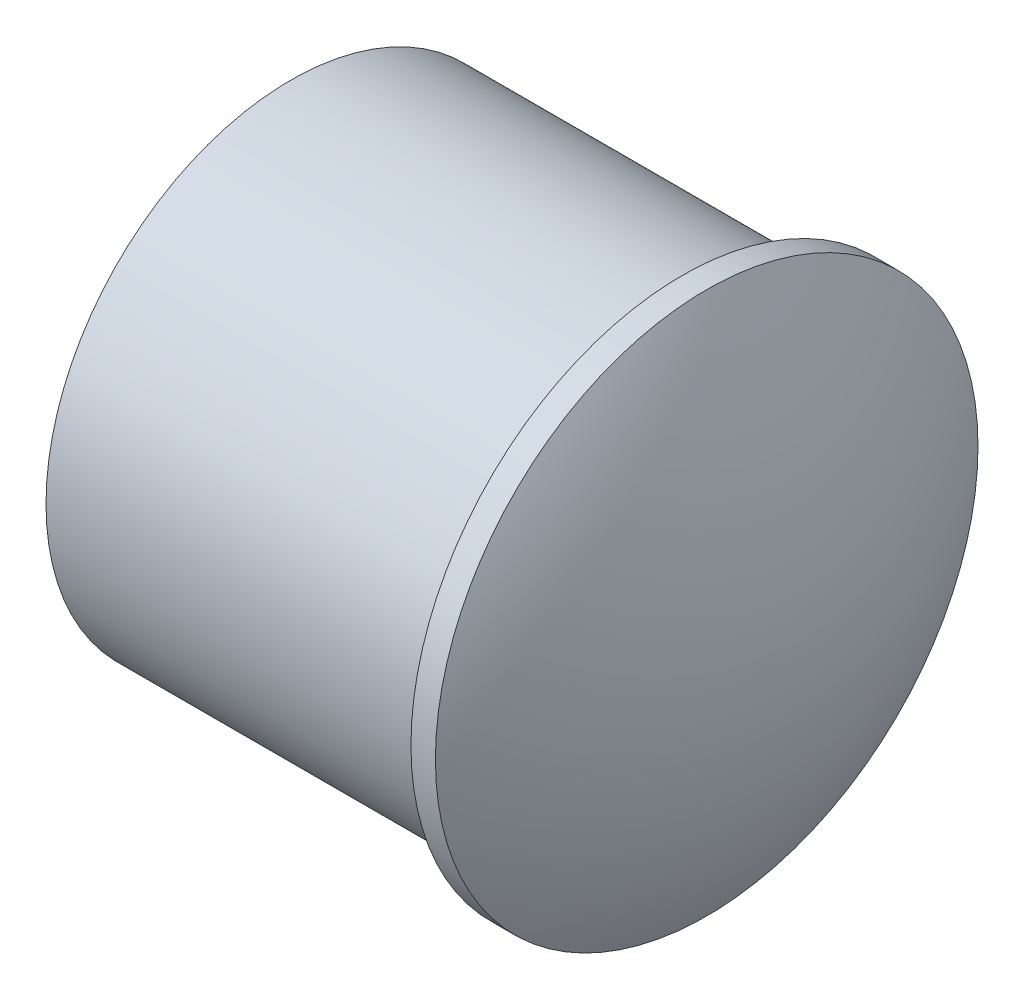
ISO-10303-21;
HEADER;
FILE_DESCRIPTION(('STEP AP214'),'2;1');
FILE_NAME('part.step','',(''),(''),'','','');
FILE_SCHEMA(('AUTOMOTIVE_DESIGN { 1 0 10303 214 1 1 1 1 }'));
ENDSEC;
DATA;
#1=APPLICATION_CONTEXT('core data for automotive mechanical design processes');
#2=APPLICATION_PROTOCOL_DEFINITION('international standard','automotive_design',2000,#1);
#3=PRODUCT_CONTEXT('',#1,'mechanical');
#4=PRODUCT('Part','Part','',(#3));
#5=PRODUCT_RELATED_PRODUCT_CATEGORY('part','',(#4));
#6=PRODUCT_DEFINITION_FORMATION('','',#4);
#7=PRODUCT_DEFINITION_CONTEXT('part definition',#1,'design');
#8=PRODUCT_DEFINITION('design','',#6,#7);
#9=PRODUCT_DEFINITION_SHAPE('','',#8);
#10=(LENGTH_UNIT() NAMED_UNIT(*) SI_UNIT(.MILLI.,.METRE.));
#11=(NAMED_UNIT(*) PLANE_ANGLE_UNIT() SI_UNIT($,.RADIAN.));
#12=(NAMED_UNIT(*) SI_UNIT($,.STERADIAN.) SOLID_ANGLE_UNIT());
#13=UNCERTAINTY_MEASURE_WITH_UNIT(LENGTH_MEASURE(1.E-05),#10,'distance_accuracy_value','');
#14=(GEOMETRIC_REPRESENTATION_CONTEXT(3) GLOBAL_UNCERTAINTY_ASSIGNED_CONTEXT((#13)) GLOBAL_UNIT_ASSIGNED_CONTEXT((#10,
#11,#12)) REPRESENTATION_CONTEXT('',''));
#15=CARTESIAN_POINT('',(0.,0.,0.));
#16=DIRECTION('',(0.,0.,1.));
#17=DIRECTION('',(1.,0.,0.));
#18=AXIS2_PLACEMENT_3D('',#15,#16,#17);
#19=CARTESIAN_POINT('',(0.,0.,0.));
#20=DIRECTION('',(1.,0.,0.));
#21=DIRECTION('',(0.,0.,-1.));
#22=AXIS2_PLACEMENT_3D('',#19,#20,#21);
#23=PLANE('',#22);
#24=CARTESIAN_POINT('',(0.,0.,0.));
#25=DIRECTION('',(-1.,0.,0.));
#26=DIRECTION('',(0.,0.,1.));
#27=AXIS2_PLACEMENT_3D('',#24,#25,#26);
#28=CIRCLE('',#27,10.);
#29=CARTESIAN_POINT('',(0.,0.,10.));
#30=VERTEX_POINT('',#29);
#31=EDGE_CURVE('E11',#30,#30,#28,.T.);
#32=ORIENTED_EDGE('',*,*,#31,.T.);
#33=EDGE_LOOP('',(#32));
#34=FACE_BOUND('',#33,.T.);
#35=ADVANCED_FACE('F39',(#34),#23,.F.);
#36=CARTESIAN_POINT('',(0.,0.,0.));
#37=DIRECTION('',(-1.,0.,0.));
#38=DIRECTION('',(0.,0.,1.));
#39=AXIS2_PLACEMENT_3D('',#36,#37,#38);
#40=CYLINDRICAL_SURFACE('',#39,10.);
#41=ORIENTED_EDGE('',*,*,#31,.F.);
#42=EDGE_LOOP('',(#41));
#43=FACE_BOUND('',#42,.T.);
#44=CARTESIAN_POINT('',(16.,0.,0.));
#45=DIRECTION('',(-1.,0.,0.));
#46=DIRECTION('',(0.,0.,1.));
#47=AXIS2_PLACEMENT_3D('',#44,#45,#46);
#48=CIRCLE('',#47,10.);
#49=CARTESIAN_POINT('',(16.,0.,10.));
#50=VERTEX_POINT('',#49);
#51=EDGE_CURVE('E46',#50,#50,#48,.T.);
#52=ORIENTED_EDGE('',*,*,#51,.T.);
#53=EDGE_LOOP('',(#52));
#54=FACE_BOUND('',#53,.T.);
#55=ADVANCED_FACE('F62',(#43,#54),#40,.T.);
#56=CARTESIAN_POINT('',(16.,10.,0.));
#57=DIRECTION('',(1.,0.,0.));
#58=DIRECTION('',(0.,0.,-1.));
#59=AXIS2_PLACEMENT_3D('',#56,#57,#58);
#60=PLANE('',#59);
#61=ORIENTED_EDGE('',*,*,#51,.F.);
#62=EDGE_LOOP('',(#61));
#63=FACE_BOUND('',#62,.T.);
#64=CARTESIAN_POINT('',(16.,0.,0.));
#65=DIRECTION('',(-1.,0.,0.));
#66=DIRECTION('',(0.,0.,1.));
#67=AXIS2_PLACEMENT_3D('',#64,#65,#66);
#68=CIRCLE('',#67,11.0866749850914);
#69=CARTESIAN_POINT('',(16.,0.,11.0866749850914));
#70=VERTEX_POINT('',#69);
#71=EDGE_CURVE('E74',#70,#70,#68,.T.);
#72=ORIENTED_EDGE('',*,*,#71,.T.);
#73=EDGE_LOOP('',(#72));
#74=FACE_BOUND('',#73,.T.);
#75=ADVANCED_FACE('F57',(#63,#74),#60,.F.);
#76=CARTESIAN_POINT('',(0.,0.,0.));
#77=DIRECTION('',(-1.,0.,0.));
#78=DIRECTION('',(0.,0.,1.));
#79=AXIS2_PLACEMENT_3D('',#76,#77,#78);
#80=CYLINDRICAL_SURFACE('',#79,11.0866749850914);
#81=ORIENTED_EDGE('',*,*,#71,.F.);
#82=EDGE_LOOP('',(#81));
#83=FACE_BOUND('',#82,.T.);
#84=CARTESIAN_POINT('',(17.,0.,0.));
#85=DIRECTION('',(-1.,0.,0.));
#86=DIRECTION('',(0.,0.,1.));
#87=AXIS2_PLACEMENT_3D('',#84,#85,#86);
#88=CIRCLE('',#87,11.0866749850914);
#89=CARTESIAN_POINT('',(17.,0.,11.0866749850914));
#90=VERTEX_POINT('',#89);
#91=EDGE_CURVE('E77',#90,#90,#88,.T.);
#92=ORIENTED_EDGE('',*,*,#91,.T.);
#93=EDGE_LOOP('',(#92));
#94=FACE_BOUND('',#93,.T.);
#95=ADVANCED_FACE('F51',(#83,#94),#80,.T.);
#96=CARTESIAN_POINT('',(-3.03411455309165,0.,-0.283688531591132));
#97=DIRECTION('',(0.,-1.,0.));
#98=DIRECTION('',(0.,0.,1.));
#99=AXIS2_PLACEMENT_3D('',#96,#97,#98);
#100=CIRCLE('',#99,23.0358614431478);
#101=TRIMMED_CURVE('',#100,(PARAMETER_VALUE(-1.5584809330971)),
(PARAMETER_VALUE(1.5584809330971)),.T.,.PARAMETER.);
#102=CARTESIAN_POINT('',(-3.03411455309165,0.,0.));
#103=DIRECTION('',(-1.,0.,0.));
#104=AXIS1_PLACEMENT('',#102,#103);
#105=SURFACE_OF_REVOLUTION('',#101,#104);
#106=ORIENTED_EDGE('',*,*,#91,.F.);
#107=EDGE_LOOP('',(#106));
#108=FACE_BOUND('',#107,.T.);
#109=CARTESIAN_POINT('',(20.,0.,0.));
#110=VERTEX_POINT('',#109);
#111=VERTEX_LOOP('',#110);
#112=FACE_BOUND('',#111,.T.);
#113=ADVANCED_FACE('F49',(#108,#112),#105,.T.);
#114=CLOSED_SHELL('',(#35,#55,#75,#95,#113));
#115=MANIFOLD_SOLID_BREP('B2',#114);
#116=ADVANCED_BREP_SHAPE_REPRESENTATION('',(#18,#115),#14);
#117=SHAPE_DEFINITION_REPRESENTATION(#9,#116);
ENDSEC;
END-ISO-10303-21;
